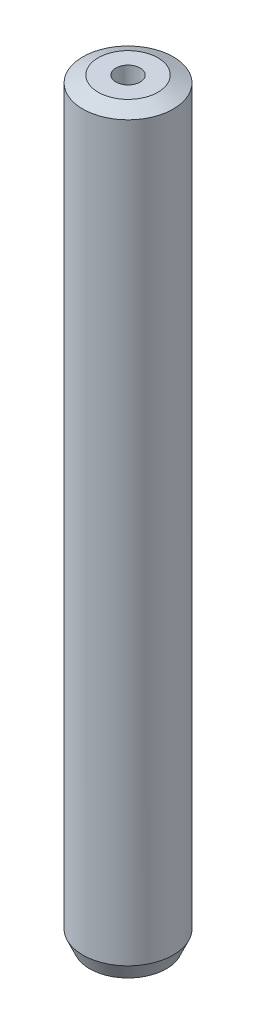
ISO-10303-21;
HEADER;
FILE_DESCRIPTION(('STEP AP214'),'2;1');
FILE_NAME('part.step','',(''),(''),'','','');
FILE_SCHEMA(('AUTOMOTIVE_DESIGN { 1 0 10303 214 1 1 1 1 }'));
ENDSEC;
DATA;
#1=APPLICATION_CONTEXT('core data for automotive mechanical design processes');
#2=APPLICATION_PROTOCOL_DEFINITION('international standard','automotive_design',2000,#1);
#3=PRODUCT_CONTEXT('',#1,'mechanical');
#4=PRODUCT('Part','Part','',(#3));
#5=PRODUCT_RELATED_PRODUCT_CATEGORY('part','',(#4));
#6=PRODUCT_DEFINITION_FORMATION('','',#4);
#7=PRODUCT_DEFINITION_CONTEXT('part definition',#1,'design');
#8=PRODUCT_DEFINITION('design','',#6,#7);
#9=PRODUCT_DEFINITION_SHAPE('','',#8);
#10=(LENGTH_UNIT() NAMED_UNIT(*) SI_UNIT(.MILLI.,.METRE.));
#11=(NAMED_UNIT(*) PLANE_ANGLE_UNIT() SI_UNIT($,.RADIAN.));
#12=(NAMED_UNIT(*) SI_UNIT($,.STERADIAN.) SOLID_ANGLE_UNIT());
#13=UNCERTAINTY_MEASURE_WITH_UNIT(LENGTH_MEASURE(1.E-05),#10,'distance_accuracy_value','');
#14=(GEOMETRIC_REPRESENTATION_CONTEXT(3) GLOBAL_UNCERTAINTY_ASSIGNED_CONTEXT((#13)) GLOBAL_UNIT_ASSIGNED_CONTEXT((#10,
#11,#12)) REPRESENTATION_CONTEXT('',''));
#15=CARTESIAN_POINT('',(0.,0.,0.));
#16=DIRECTION('',(0.,0.,1.));
#17=DIRECTION('',(1.,0.,0.));
#18=AXIS2_PLACEMENT_3D('',#15,#16,#17);
#19=CARTESIAN_POINT('',(0.,166.820570597186,0.));
#20=DIRECTION('',(0.,-1.,0.));
#21=DIRECTION('',(0.,0.,-1.));
#22=AXIS2_PLACEMENT_3D('',#19,#20,#21);
#23=CYLINDRICAL_SURFACE('',#22,10.);
#24=CARTESIAN_POINT('',(0.,165.311473715083,0.));
#25=DIRECTION('',(0.,1.,0.));
#26=DIRECTION('',(0.,0.,1.));
#27=AXIS2_PLACEMENT_3D('',#24,#25,#26);
#28=CIRCLE('',#27,10.);
#29=CARTESIAN_POINT('',(0.,165.311473715083,-10.));
#30=VERTEX_POINT('',#29);
#31=EDGE_CURVE('E50',#30,#30,#28,.F.);
#32=ORIENTED_EDGE('',*,*,#31,.T.);
#33=EDGE_LOOP('',(#32));
#34=FACE_BOUND('',#33,.T.);
#35=CARTESIAN_POINT('',(0.,3.39900241036398,0.));
#36=DIRECTION('',(0.,1.,0.));
#37=DIRECTION('',(0.,0.,1.));
#38=AXIS2_PLACEMENT_3D('',#35,#36,#37);
#39=CIRCLE('',#38,10.);
#40=CARTESIAN_POINT('',(0.,3.39900241036398,10.));
#41=VERTEX_POINT('',#40);
#42=EDGE_CURVE('E51',#41,#41,#39,.T.);
#43=ORIENTED_EDGE('',*,*,#42,.T.);
#44=EDGE_LOOP('',(#43));
#45=FACE_BOUND('',#44,.T.);
#46=ADVANCED_FACE('F39',(#34,#45),#23,.T.);
#47=CARTESIAN_POINT('',(0.,166.820570597186,0.));
#48=DIRECTION('',(0.,1.,0.));
#49=DIRECTION('',(0.,0.,1.));
#50=AXIS2_PLACEMENT_3D('',#47,#48,#49);
#51=PLANE('',#50);
#52=CARTESIAN_POINT('',(0.,166.820570597186,0.));
#53=DIRECTION('',(0.,1.,0.));
#54=DIRECTION('',(0.,0.,1.));
#55=AXIS2_PLACEMENT_3D('',#52,#53,#54);
#56=CIRCLE('',#55,6.60099758963598);
#57=CARTESIAN_POINT('',(0.,166.820570597186,-6.60099758963601));
#58=VERTEX_POINT('',#57);
#59=EDGE_CURVE('E54',#58,#58,#56,.T.);
#60=ORIENTED_EDGE('',*,*,#59,.T.);
#61=EDGE_LOOP('',(#60));
#62=FACE_BOUND('',#61,.T.);
#63=CARTESIAN_POINT('',(0.,166.820570597186,0.));
#64=DIRECTION('',(0.,1.,0.));
#65=DIRECTION('',(0.,0.,1.));
#66=AXIS2_PLACEMENT_3D('',#63,#64,#65);
#67=CIRCLE('',#66,2.68626258966647);
#68=CARTESIAN_POINT('',(0.,166.820570597186,2.68626258966647));
#69=VERTEX_POINT('',#68);
#70=EDGE_CURVE('E58',#69,#69,#67,.T.);
#71=ORIENTED_EDGE('',*,*,#70,.F.);
#72=EDGE_LOOP('',(#71));
#73=FACE_BOUND('',#72,.T.);
#74=ADVANCED_FACE('F69',(#62,#73),#51,.T.);
#75=CARTESIAN_POINT('',(0.,0.,0.));
#76=DIRECTION('',(0.,1.,0.));
#77=DIRECTION('',(0.,0.,1.));
#78=AXIS2_PLACEMENT_3D('',#75,#76,#77);
#79=PLANE('',#78);
#80=CARTESIAN_POINT('',(0.,0.,0.));
#81=DIRECTION('',(0.,1.,0.));
#82=DIRECTION('',(0.,0.,1.));
#83=AXIS2_PLACEMENT_3D('',#80,#81,#82);
#84=CIRCLE('',#83,8.49090311789734);
#85=CARTESIAN_POINT('',(0.,0.,8.49090311789734));
#86=VERTEX_POINT('',#85);
#87=EDGE_CURVE('E10',#86,#86,#84,.F.);
#88=ORIENTED_EDGE('',*,*,#87,.T.);
#89=EDGE_LOOP('',(#88));
#90=FACE_BOUND('',#89,.T.);
#91=CARTESIAN_POINT('',(0.,0.,0.));
#92=DIRECTION('',(0.,1.,0.));
#93=DIRECTION('',(0.,0.,1.));
#94=AXIS2_PLACEMENT_3D('',#91,#92,#93);
#95=CIRCLE('',#94,2.68626258966647);
#96=CARTESIAN_POINT('',(0.,0.,2.68626258966647));
#97=VERTEX_POINT('',#96);
#98=EDGE_CURVE('E63',#97,#97,#95,.T.);
#99=ORIENTED_EDGE('',*,*,#98,.T.);
#100=EDGE_LOOP('',(#99));
#101=FACE_BOUND('',#100,.T.);
#102=ADVANCED_FACE('F75',(#90,#101),#79,.F.);
#103=CARTESIAN_POINT('',(0.,166.820570597186,0.));
#104=DIRECTION('',(0.,-1.,0.));
#105=DIRECTION('',(0.,0.,-1.));
#106=AXIS2_PLACEMENT_3D('',#103,#104,#105);
#107=CYLINDRICAL_SURFACE('',#106,2.68626258966647);
#108=ORIENTED_EDGE('',*,*,#70,.T.);
#109=EDGE_LOOP('',(#108));
#110=FACE_BOUND('',#109,.T.);
#111=ORIENTED_EDGE('',*,*,#98,.F.);
#112=EDGE_LOOP('',(#111));
#113=FACE_BOUND('',#112,.T.);
#114=ADVANCED_FACE('F70',(#110,#113),#107,.F.);
#115=CARTESIAN_POINT('',(0.,166.820570597186,0.));
#116=DIRECTION('',(0.,-1.,0.));
#117=DIRECTION('',(0.,0.,-1.));
#118=AXIS2_PLACEMENT_3D('',#115,#116,#117);
#119=CONICAL_SURFACE('',#118,6.60099758963598,1.15295798416179);
#120=CARTESIAN_POINT('',(0.,165.311473715083,-10.));
#121=CARTESIAN_POINT('',(0.,165.327193474272,-9.96459372489207));
#122=CARTESIAN_POINT('',(0.,165.34291323346,-9.92918744978411));
#123=CARTESIAN_POINT('',(0.,165.374352751837,-9.8583748995682));
#124=CARTESIAN_POINT('',(0.,165.390072511026,-9.82296862446024));
#125=CARTESIAN_POINT('',(0.,165.421512029403,-9.75215607424432));
#126=CARTESIAN_POINT('',(0.,165.437231788592,-9.71674979913636));
#127=CARTESIAN_POINT('',(0.,165.468671306969,-9.64593724892045));
#128=CARTESIAN_POINT('',(0.,165.484391066157,-9.61053097381249));
#129=CARTESIAN_POINT('',(0.,165.515830584535,-9.53971842359657));
#130=CARTESIAN_POINT('',(0.,165.531550343723,-9.50431214848861));
#131=CARTESIAN_POINT('',(0.,165.5629898621,-9.43349959827269));
#132=CARTESIAN_POINT('',(0.,165.578709621289,-9.39809332316474));
#133=CARTESIAN_POINT('',(0.,165.610149139666,-9.32728077294882));
#134=CARTESIAN_POINT('',(0.,165.625868898855,-9.29187449784086));
#135=CARTESIAN_POINT('',(0.,165.657308417232,-9.22106194762494));
#136=CARTESIAN_POINT('',(0.,165.67302817642,-9.18565567251698));
#137=CARTESIAN_POINT('',(0.,165.704467694797,-9.11484312230107));
#138=CARTESIAN_POINT('',(0.,165.720187453986,-9.07943684719311));
#139=CARTESIAN_POINT('',(0.,165.751626972363,-9.00862429697719));
#140=CARTESIAN_POINT('',(0.,165.767346731552,-8.97321802186923));
#141=CARTESIAN_POINT('',(0.,165.798786249929,-8.90240547165332));
#142=CARTESIAN_POINT('',(0.,165.814506009117,-8.86699919654536));
#143=CARTESIAN_POINT('',(0.,165.845945527495,-8.79618664632944));
#144=CARTESIAN_POINT('',(0.,165.861665286683,-8.76078037122148));
#145=CARTESIAN_POINT('',(0.,165.89310480506,-8.68996782100557));
#146=CARTESIAN_POINT('',(0.,165.908824564249,-8.65456154589761));
#147=CARTESIAN_POINT('',(0.,165.940264082626,-8.58374899568169));
#148=CARTESIAN_POINT('',(0.,165.955983841815,-8.54834272057373));
#149=CARTESIAN_POINT('',(0.,165.987423360192,-8.47753017035781));
#150=CARTESIAN_POINT('',(0.,166.00314311938,-8.44212389524986));
#151=CARTESIAN_POINT('',(0.,166.034582637757,-8.37131134503394));
#152=CARTESIAN_POINT('',(0.,166.050302396946,-8.33590506992598));
#153=CARTESIAN_POINT('',(0.,166.081741915323,-8.26509251971006));
#154=CARTESIAN_POINT('',(0.,166.097461674512,-8.2296862446021));
#155=CARTESIAN_POINT('',(0.,166.128901192889,-8.15887369438618));
#156=CARTESIAN_POINT('',(0.,166.144620952077,-8.12346741927823));
#157=CARTESIAN_POINT('',(0.,166.176060470455,-8.05265486906231));
#158=CARTESIAN_POINT('',(0.,166.191780229643,-8.01724859395435));
#159=CARTESIAN_POINT('',(0.,166.22321974802,-7.94643604373843));
#160=CARTESIAN_POINT('',(0.,166.238939507209,-7.91102976863047));
#161=CARTESIAN_POINT('',(0.,166.270379025586,-7.84021721841456));
#162=CARTESIAN_POINT('',(0.,166.286098784774,-7.8048109433066));
#163=CARTESIAN_POINT('',(0.,166.317538303152,-7.73399839309068));
#164=CARTESIAN_POINT('',(0.,166.33325806234,-7.69859211798272));
#165=CARTESIAN_POINT('',(0.,166.364697580717,-7.6277795677668));
#166=CARTESIAN_POINT('',(0.,166.380417339906,-7.59237329265885));
#167=CARTESIAN_POINT('',(0.,166.411856858283,-7.52156074244293));
#168=CARTESIAN_POINT('',(0.,166.427576617472,-7.48615446733497));
#169=CARTESIAN_POINT('',(0.,166.459016135849,-7.41534191711906));
#170=CARTESIAN_POINT('',(0.,166.474735895037,-7.3799356420111));
#171=CARTESIAN_POINT('',(0.,166.506175413414,-7.30912309179518));
#172=CARTESIAN_POINT('',(0.,166.521895172603,-7.27371681668722));
#173=CARTESIAN_POINT('',(0.,166.55333469098,-7.2029042664713));
#174=CARTESIAN_POINT('',(0.,166.569054450169,-7.16749799136335));
#175=CARTESIAN_POINT('',(0.,166.600493968546,-7.09668544114743));
#176=CARTESIAN_POINT('',(0.,166.616213727734,-7.06127916603947));
#177=CARTESIAN_POINT('',(0.,166.647653246112,-6.99046661582355));
#178=CARTESIAN_POINT('',(0.,166.6633730053,-6.95506034071559));
#179=CARTESIAN_POINT('',(0.,166.694812523677,-6.88424779049968));
#180=CARTESIAN_POINT('',(0.,166.710532282866,-6.84884151539172));
#181=CARTESIAN_POINT('',(0.,166.741971801243,-6.7780289651758));
#182=CARTESIAN_POINT('',(0.,166.757691560432,-6.74262269006784));
#183=CARTESIAN_POINT('',(0.,166.789131078809,-6.67181013985192));
#184=CARTESIAN_POINT('',(0.,166.804850837997,-6.63640386474397));
#185=CARTESIAN_POINT('',(0.,166.820570597186,-6.60099758963601));
#186=B_SPLINE_CURVE_WITH_KNOTS('',3,(#120,#121,#122,#123,#124,#125,#126,#127,#128,#129,#130,
#131,#132,#133,#134,#135,#136,#137,#138,#139,#140,#141,#142,#143,#144,#145,#146,#147,#148,#149,
#150,#151,#152,#153,#154,#155,#156,#157,#158,#159,#160,#161,#162,#163,#164,#165,#166,#167,#168,
#169,#170,#171,#172,#173,#174,#175,#176,#177,#178,#179,#180,#181,#182,#183,#184,#185),
.UNSPECIFIED.,.F.,.F.,(4,2,2,2,2,2,2,2,2,2,2,2,2,2,2,2,2,2,2,2,2,2,2,2,2,2,2,2,2,2,2,2,4),(0.,
0.116217194569913,0.23243438913984,0.348651583709764,0.464868778279689,0.581085972849615,
0.69730316741954,0.813520361989464,0.92973755655939,1.04595475112932,1.16217194569924,
1.27838914026915,1.39460633483908,1.510823529409,1.62704072397893,1.74325791854886,
1.85947511311878,1.97569230768871,2.09190950225863,2.20812669682855,2.32434389139848,
2.44056108596841,2.55677828053832,2.67299547510824,2.78921266967817,2.90542986424809,
3.02164705881802,3.13786425338794,3.25408144795787,3.37029864252779,3.48651583709772,
3.60273303166765,3.71895022623757),.UNSPECIFIED.);
#187=EDGE_CURVE('BSEAM81',#30,#58,#186,.T.);
#188=ORIENTED_EDGE('',*,*,#31,.F.);
#189=ORIENTED_EDGE('',*,*,#59,.F.);
#190=ORIENTED_EDGE('',*,*,#187,.T.);
#191=ORIENTED_EDGE('',*,*,#187,.F.);
#192=EDGE_LOOP('',(#188,#190,#189,#191));
#193=FACE_BOUND('',#192,.T.);
#194=ADVANCED_FACE('F81',(#193),#119,.T.);
#195=CARTESIAN_POINT('',(0.,3.39900241036398,0.));
#196=DIRECTION('',(0.,1.,0.));
#197=DIRECTION('',(0.,0.,1.));
#198=AXIS2_PLACEMENT_3D('',#195,#196,#197);
#199=CONICAL_SURFACE('',#198,10.,0.417838342633107);
#200=ORIENTED_EDGE('',*,*,#87,.F.);
#201=EDGE_LOOP('',(#200));
#202=FACE_BOUND('',#201,.T.);
#203=ORIENTED_EDGE('',*,*,#42,.F.);
#204=EDGE_LOOP('',(#203));
#205=FACE_BOUND('',#204,.T.);
#206=ADVANCED_FACE('F45',(#202,#205),#199,.T.);
#207=CLOSED_SHELL('',(#46,#74,#102,#114,#194,#206));
#208=MANIFOLD_SOLID_BREP('B2',#207);
#209=ADVANCED_BREP_SHAPE_REPRESENTATION('',(#18,#208),#14);
#210=SHAPE_DEFINITION_REPRESENTATION(#9,#209);
ENDSEC;
END-ISO-10303-21;
